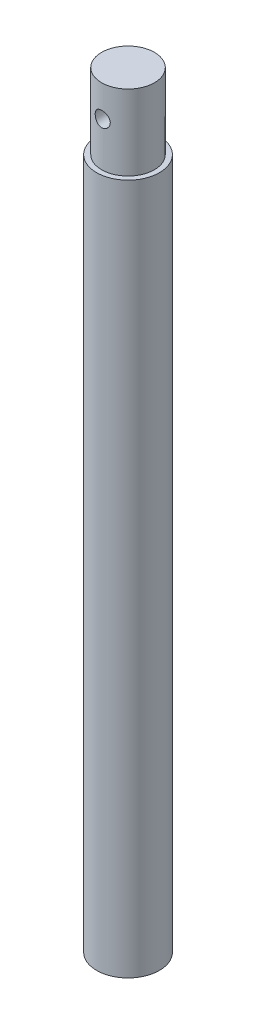
ISO-10303-21;
HEADER;
FILE_DESCRIPTION(('STEP AP214'),'2;1');
FILE_NAME('part.step','',(''),(''),'','','');
FILE_SCHEMA(('AUTOMOTIVE_DESIGN { 1 0 10303 214 1 1 1 1 }'));
ENDSEC;
DATA;
#1=APPLICATION_CONTEXT('core data for automotive mechanical design processes');
#2=APPLICATION_PROTOCOL_DEFINITION('international standard','automotive_design',2000,#1);
#3=PRODUCT_CONTEXT('',#1,'mechanical');
#4=PRODUCT('Part','Part','',(#3));
#5=PRODUCT_RELATED_PRODUCT_CATEGORY('part','',(#4));
#6=PRODUCT_DEFINITION_FORMATION('','',#4);
#7=PRODUCT_DEFINITION_CONTEXT('part definition',#1,'design');
#8=PRODUCT_DEFINITION('design','',#6,#7);
#9=PRODUCT_DEFINITION_SHAPE('','',#8);
#10=(LENGTH_UNIT() NAMED_UNIT(*) SI_UNIT(.MILLI.,.METRE.));
#11=(NAMED_UNIT(*) PLANE_ANGLE_UNIT() SI_UNIT($,.RADIAN.));
#12=(NAMED_UNIT(*) SI_UNIT($,.STERADIAN.) SOLID_ANGLE_UNIT());
#13=UNCERTAINTY_MEASURE_WITH_UNIT(LENGTH_MEASURE(1.E-05),#10,'distance_accuracy_value','');
#14=(GEOMETRIC_REPRESENTATION_CONTEXT(3) GLOBAL_UNCERTAINTY_ASSIGNED_CONTEXT((#13)) GLOBAL_UNIT_ASSIGNED_CONTEXT((#10,
#11,#12)) REPRESENTATION_CONTEXT('',''));
#15=CARTESIAN_POINT('',(0.,0.,0.));
#16=DIRECTION('',(0.,0.,1.));
#17=DIRECTION('',(1.,0.,0.));
#18=AXIS2_PLACEMENT_3D('',#15,#16,#17);
#19=CARTESIAN_POINT('',(0.,0.,0.));
#20=DIRECTION('',(0.,-1.,0.));
#21=DIRECTION('',(0.,0.,-1.));
#22=AXIS2_PLACEMENT_3D('',#19,#20,#21);
#23=PLANE('',#22);
#24=CARTESIAN_POINT('',(0.,0.,0.));
#25=DIRECTION('',(0.,-1.,0.));
#26=DIRECTION('',(0.,0.,-1.));
#27=AXIS2_PLACEMENT_3D('',#24,#25,#26);
#28=CIRCLE('',#27,12.5);
#29=CARTESIAN_POINT('',(0.,0.,-12.5));
#30=VERTEX_POINT('',#29);
#31=EDGE_CURVE('E10',#30,#30,#28,.T.);
#32=ORIENTED_EDGE('',*,*,#31,.T.);
#33=EDGE_LOOP('',(#32));
#34=FACE_BOUND('',#33,.T.);
#35=ADVANCED_FACE('F31',(#34),#23,.T.);
#36=CARTESIAN_POINT('',(0.,0.,0.));
#37=DIRECTION('',(0.,-1.,0.));
#38=DIRECTION('',(0.,0.,-1.));
#39=AXIS2_PLACEMENT_3D('',#36,#37,#38);
#40=CYLINDRICAL_SURFACE('',#39,12.5);
#41=CARTESIAN_POINT('',(0.,275.,0.));
#42=DIRECTION('',(0.,-1.,0.));
#43=DIRECTION('',(0.,0.,-1.));
#44=AXIS2_PLACEMENT_3D('',#41,#42,#43);
#45=CIRCLE('',#44,12.5);
#46=CARTESIAN_POINT('',(0.,275.,-12.5));
#47=VERTEX_POINT('',#46);
#48=EDGE_CURVE('E43',#47,#47,#45,.T.);
#49=ORIENTED_EDGE('',*,*,#48,.T.);
#50=EDGE_LOOP('',(#49));
#51=FACE_BOUND('',#50,.T.);
#52=ORIENTED_EDGE('',*,*,#31,.F.);
#53=EDGE_LOOP('',(#52));
#54=FACE_BOUND('',#53,.T.);
#55=ADVANCED_FACE('F75',(#51,#54),#40,.T.);
#56=CARTESIAN_POINT('',(12.5,275.,0.));
#57=DIRECTION('',(0.,1.,0.));
#58=DIRECTION('',(0.,0.,1.));
#59=AXIS2_PLACEMENT_3D('',#56,#57,#58);
#60=PLANE('',#59);
#61=CARTESIAN_POINT('',(0.,275.,0.));
#62=DIRECTION('',(0.,-1.,0.));
#63=DIRECTION('',(0.,0.,-1.));
#64=AXIS2_PLACEMENT_3D('',#61,#62,#63);
#65=CIRCLE('',#64,10.5);
#66=CARTESIAN_POINT('',(0.,275.,-10.5));
#67=VERTEX_POINT('',#66);
#68=EDGE_CURVE('E48',#67,#67,#65,.T.);
#69=ORIENTED_EDGE('',*,*,#68,.T.);
#70=EDGE_LOOP('',(#69));
#71=FACE_BOUND('',#70,.T.);
#72=ORIENTED_EDGE('',*,*,#48,.F.);
#73=EDGE_LOOP('',(#72));
#74=FACE_BOUND('',#73,.T.);
#75=ADVANCED_FACE('F71',(#71,#74),#60,.T.);
#76=CARTESIAN_POINT('',(0.,0.,0.));
#77=DIRECTION('',(0.,-1.,0.));
#78=DIRECTION('',(0.,0.,-1.));
#79=AXIS2_PLACEMENT_3D('',#76,#77,#78);
#80=CYLINDRICAL_SURFACE('',#79,10.5);
#81=CARTESIAN_POINT('',(0.,295.5,-10.5));
#82=CARTESIAN_POINT('',(0.164932353565877,295.499997090657,-10.4999980394151));
#83=CARTESIAN_POINT('',(0.329894621808872,295.486353316536,-10.4960762610306));
#84=CARTESIAN_POINT('',(0.655037986795479,295.432253594847,-10.4808135891765));
#85=CARTESIAN_POINT('',(0.815217250244417,295.391787500889,-10.4694698881513));
#86=CARTESIAN_POINT('',(1.1260564511068,295.285487942375,-10.4406103702361));
#87=CARTESIAN_POINT('',(1.27672932127233,295.219689845772,-10.4231031615951));
#88=CARTESIAN_POINT('',(1.5649031416939,295.064733012783,-10.3837496747482));
#89=CARTESIAN_POINT('',(1.70240271176725,294.975571832265,-10.3619029426203));
#90=CARTESIAN_POINT('',(1.96394167028842,294.773947483991,-10.3155710193837));
#91=CARTESIAN_POINT('',(2.08758558357141,294.660982869217,-10.2910356291779));
#92=CARTESIAN_POINT('',(2.31445703688652,294.416028385294,-10.2424010237346));
#93=CARTESIAN_POINT('',(2.41768151561674,294.284035668552,-10.2183018743902));
#94=CARTESIAN_POINT('',(2.60279685009645,294.001509625814,-10.1727452231308));
#95=CARTESIAN_POINT('',(2.68421731655021,293.850657022403,-10.1513505375903));
#96=CARTESIAN_POINT('',(2.82037755830969,293.536691982374,-10.11437015761));
#97=CARTESIAN_POINT('',(2.87512307333578,293.373582191894,-10.0987832136731));
#98=CARTESIAN_POINT('',(2.95497649520813,293.044147855252,-10.0757041229402));
#99=CARTESIAN_POINT('',(2.98080829804275,292.878012955848,-10.0680146785502));
#100=CARTESIAN_POINT('',(3.00436001683776,292.543603277331,-10.0610131230299));
#101=CARTESIAN_POINT('',(3.00208604114431,292.375328971125,-10.0616991916142));
#102=CARTESIAN_POINT('',(2.97006202144355,292.047197082816,-10.071195516149));
#103=CARTESIAN_POINT('',(2.94120488592586,291.887243473229,-10.079741740469));
#104=CARTESIAN_POINT('',(2.85827079128683,291.574549170559,-10.1035702257422));
#105=CARTESIAN_POINT('',(2.80419155221875,291.421809130919,-10.1188530956461));
#106=CARTESIAN_POINT('',(2.67166021706719,291.125630633352,-10.1546529527412));
#107=CARTESIAN_POINT('',(2.59290826759323,290.982334391398,-10.1752337460847));
#108=CARTESIAN_POINT('',(2.41347568751828,290.71068515818,-10.2192782532309));
#109=CARTESIAN_POINT('',(2.31279017510018,290.582335503398,-10.2427426083287));
#110=CARTESIAN_POINT('',(2.08785599509534,290.339141436591,-10.2909937598453));
#111=CARTESIAN_POINT('',(1.96286231226802,290.224988286049,-10.3157970685855));
#112=CARTESIAN_POINT('',(1.69519842357936,290.01911099454,-10.3631437082752));
#113=CARTESIAN_POINT('',(1.55252730222285,289.927388015937,-10.3856869220674));
#114=CARTESIAN_POINT('',(1.25238460963716,289.768606897839,-10.4261479209825));
#115=CARTESIAN_POINT('',(1.094834726715,289.701689569794,-10.4440391324584));
#116=CARTESIAN_POINT('',(0.770089844951189,289.595499162875,-10.4729887723138));
#117=CARTESIAN_POINT('',(0.602897288715204,289.556219116132,-10.4840489228438));
#118=CARTESIAN_POINT('',(0.269499582966511,289.507540071436,-10.4978231177201));
#119=CARTESIAN_POINT('',(0.103442020290751,289.497202956941,-10.500799092759));
#120=CARTESIAN_POINT('',(-0.22803979020838,289.504090899452,-10.4988312706064));
#121=CARTESIAN_POINT('',(-0.393464111635665,289.521312649269,-10.4938884237094));
#122=CARTESIAN_POINT('',(-0.715527950145472,289.582065666474,-10.4768089002781));
#123=CARTESIAN_POINT('',(-0.872277317602265,289.625059771985,-10.4648191952651));
#124=CARTESIAN_POINT('',(-1.17631302930846,289.735500752977,-10.4350199811283));
#125=CARTESIAN_POINT('',(-1.32359827687307,289.802950456334,-10.4172097989883));
#126=CARTESIAN_POINT('',(-1.60806252768004,289.962035004968,-10.377149417537));
#127=CARTESIAN_POINT('',(-1.74495372981013,290.054161798238,-10.3548114476745));
#128=CARTESIAN_POINT('',(-2.00165779208922,290.259378758927,-10.3082692064772));
#129=CARTESIAN_POINT('',(-2.12146675626459,290.372473695097,-10.2840645113288));
#130=CARTESIAN_POINT('',(-2.34465964251011,290.620814013074,-10.2355292944394));
#131=CARTESIAN_POINT('',(-2.44737814111066,290.756662913339,-10.211220552866));
#132=CARTESIAN_POINT('',(-2.6285929741014,291.044193882937,-10.1660834210304));
#133=CARTESIAN_POINT('',(-2.70709015123023,291.195875401156,-10.1452549096911));
#134=CARTESIAN_POINT('',(-2.83706181177399,291.510136816463,-10.1096797686107));
#135=CARTESIAN_POINT('',(-2.88867949859412,291.672653645249,-10.094901000323));
#136=CARTESIAN_POINT('',(-2.96369175101872,292.00456490336,-10.0731368501614));
#137=CARTESIAN_POINT('',(-2.98709486852634,292.173957232606,-10.0661491068575));
#138=CARTESIAN_POINT('',(-3.00447036370096,292.507944049425,-10.0609755464887));
#139=CARTESIAN_POINT('',(-2.99952041465636,292.672478256889,-10.0624674105622));
#140=CARTESIAN_POINT('',(-2.96287066435293,292.99826209604,-10.0733189565375));
#141=CARTESIAN_POINT('',(-2.93117175569769,293.159511837145,-10.0826783759017));
#142=CARTESIAN_POINT('',(-2.84258953225373,293.472567556734,-10.1080046578178));
#143=CARTESIAN_POINT('',(-2.78596637679644,293.624453080512,-10.1239031558446));
#144=CARTESIAN_POINT('',(-2.64934423952273,293.916688101743,-10.1605095425217));
#145=CARTESIAN_POINT('',(-2.56934112064701,294.057035551911,-10.181218282206));
#146=CARTESIAN_POINT('',(-2.38509819802268,294.327275282707,-10.2259750342799));
#147=CARTESIAN_POINT('',(-2.28013841584102,294.456662087013,-10.2501114476943));
#148=CARTESIAN_POINT('',(-2.05028976056891,294.696335843715,-10.2985476763752));
#149=CARTESIAN_POINT('',(-1.92539587609278,294.806617978666,-10.3228475312553));
#150=CARTESIAN_POINT('',(-1.6553614812981,295.00775577649,-10.3696193935878));
#151=CARTESIAN_POINT('',(-1.50978375353968,295.098040480905,-10.3920285155618));
#152=CARTESIAN_POINT('',(-1.20487579447001,295.252718677533,-10.4317709366689));
#153=CARTESIAN_POINT('',(-1.04555313617213,295.3171263179,-10.4491070080541));
#154=CARTESIAN_POINT('',(-0.739374473002583,295.411271327093,-10.4749101708797));
#155=CARTESIAN_POINT('',(-0.593644511436613,295.444460305027,-10.4842452654312));
#156=CARTESIAN_POINT('',(-0.298617553179567,295.488824485863,-10.4967906577822));
#157=CARTESIAN_POINT('',(-0.149321036424145,295.500002633965,-10.5000017750099));
#158=CARTESIAN_POINT('',(0.,295.5,-10.5));
#159=B_SPLINE_CURVE_WITH_KNOTS('',3,(#81,#82,#83,#84,#85,#86,#87,#88,#89,#90,#91,#92,#93,#94,
#95,#96,#97,#98,#99,#100,#101,#102,#103,#104,#105,#106,#107,#108,#109,#110,#111,#112,#113,#114,
#115,#116,#117,#118,#119,#120,#121,#122,#123,#124,#125,#126,#127,#128,#129,#130,#131,#132,#133,
#134,#135,#136,#137,#138,#139,#140,#141,#142,#143,#144,#145,#146,#147,#148,#149,#150,#151,#152,
#153,#154,#155,#156,#157,#158),.UNSPECIFIED.,.T.,.F.,(4,2,2,2,2,2,2,2,2,2,2,2,2,2,2,2,2,2,2,2,2,
2,2,2,2,2,2,2,2,2,2,2,2,2,2,2,2,2,4),(0.,0.49424896881351,0.98868500969277,1.48243321934301,
1.97623310315274,2.48171717296173,2.98727696810568,3.50299612950083,4.01860427317211,
4.52099264794132,5.0232718384685,5.50927178744002,5.99531567679191,6.48751204936813,
6.97981808366011,7.49067750903752,8.00156340233173,8.51530651656676,9.02892006021922,
9.52568186547303,10.0223840615197,10.5090771071928,10.9958264486329,11.4931128801668,
11.9905125478168,12.5041815732651,13.0178327244795,13.528718600492,14.0394495868159,
14.5309002242842,15.0223344628624,15.5087564444418,15.9952645500364,16.4980148534283,
17.0008917466999,17.5166696846252,18.032165238584,18.4796920206419,18.9271589164885),.UNSPECIFIED.);
#160=CARTESIAN_POINT('',(0.,295.5,-10.5));
#161=VERTEX_POINT('',#160);
#162=EDGE_CURVE('E34',#161,#161,#159,.T.);
#163=ORIENTED_EDGE('',*,*,#162,.F.);
#164=EDGE_LOOP('',(#163));
#165=FACE_BOUND('',#164,.T.);
#166=CARTESIAN_POINT('',(3.,292.5,10.0623058987491));
#167=CARTESIAN_POINT('',(2.99999703069737,292.664777306818,10.0623082051681));
#168=CARTESIAN_POINT('',(2.98637799899365,292.829584626382,10.0663976951941));
#169=CARTESIAN_POINT('',(2.93238545085253,293.154406858294,10.0822558381005));
#170=CARTESIAN_POINT('',(2.89200105204491,293.314419793651,10.0940276144457));
#171=CARTESIAN_POINT('',(2.78594014939311,293.624905801307,10.1238106428248));
#172=CARTESIAN_POINT('',(2.72030280977814,293.775393227726,10.141812228861));
#173=CARTESIAN_POINT('',(2.56572546094404,294.063251717332,10.1820138164418));
#174=CARTESIAN_POINT('',(2.4767826849952,294.200621220567,10.2042143163778));
#175=CARTESIAN_POINT('',(2.27538720147299,294.462287347972,10.2510267482124));
#176=CARTESIAN_POINT('',(2.16238381669874,294.586151703194,10.2756863394623));
#177=CARTESIAN_POINT('',(1.91725686820389,294.813454174956,10.3242294826802));
#178=CARTESIAN_POINT('',(1.78513106873944,294.916889899684,10.3481129435048));
#179=CARTESIAN_POINT('',(1.50246904823639,295.10224297253,10.3929499800227));
#180=CARTESIAN_POINT('',(1.35163617564281,295.183724429627,10.413840817513));
#181=CARTESIAN_POINT('',(1.03771271285948,295.320002661624,10.449788107283));
#182=CARTESIAN_POINT('',(0.87462451631278,295.37480463186,10.464845695363));
#183=CARTESIAN_POINT('',(0.545337862681792,295.45475169186,10.4870927895035));
#184=CARTESIAN_POINT('',(0.379331697193584,295.480633532557,10.4944774051695));
#185=CARTESIAN_POINT('',(0.0451801536329032,295.504330100825,10.5012314348954));
#186=CARTESIAN_POINT('',(-0.12296480938281,295.502150193506,10.5006023810849));
#187=CARTESIAN_POINT('',(-0.451470293602808,295.470290437623,10.4915401014495));
#188=CARTESIAN_POINT('',(-0.611915319163379,295.441407581043,10.4833330616404));
#189=CARTESIAN_POINT('',(-0.925578333266421,295.358257346303,10.4603082949525));
#190=CARTESIAN_POINT('',(-1.07879588145081,295.303988423607,10.4454901658449));
#191=CARTESIAN_POINT('',(-1.3756107505933,295.171035898782,10.4105854765801));
#192=CARTESIAN_POINT('',(-1.51908456577589,295.092091833288,10.3904430826762));
#193=CARTESIAN_POINT('',(-1.79101086538598,294.912233120403,10.3470415346164));
#194=CARTESIAN_POINT('',(-1.91946004862498,294.811313658498,10.323781697901));
#195=CARTESIAN_POINT('',(-2.16244897282057,294.586191434074,10.2756852452718));
#196=CARTESIAN_POINT('',(-2.27634236637343,294.4612958496,10.2508219404553));
#197=CARTESIAN_POINT('',(-2.48173952362851,294.193927362224,10.2030446068904));
#198=CARTESIAN_POINT('',(-2.57324147068842,294.051453034549,10.1801307363999));
#199=CARTESIAN_POINT('',(-2.73185003977029,293.751403673275,10.1387276218934));
#200=CARTESIAN_POINT('',(-2.79875606678215,293.593717162515,10.1202751628722));
#201=CARTESIAN_POINT('',(-2.90488427239102,293.268670254839,10.0903281646055));
#202=CARTESIAN_POINT('',(-2.94411450602719,293.101312688039,10.0788316009856));
#203=CARTESIAN_POINT('',(-2.99261125801014,292.767779363481,10.0645367282499));
#204=CARTESIAN_POINT('',(-3.00285222236349,292.601757274595,10.0614556698322));
#205=CARTESIAN_POINT('',(-2.99578495079181,292.270367526124,10.0635623938704));
#206=CARTESIAN_POINT('',(-2.9784801513688,292.104999787485,10.0687491448667));
#207=CARTESIAN_POINT('',(-2.91767672138974,291.783538157964,10.0865314508271));
#208=CARTESIAN_POINT('',(-2.87478693276231,291.627318620977,10.0989546444875));
#209=CARTESIAN_POINT('',(-2.76472742799621,291.324297192004,10.1296359589553));
#210=CARTESIAN_POINT('',(-2.69755420840145,291.177496662532,10.1478949216656));
#211=CARTESIAN_POINT('',(-2.53892947682439,290.893466887175,10.1887528201424));
#212=CARTESIAN_POINT('',(-2.44691837593696,290.756564333697,10.2114479607173));
#213=CARTESIAN_POINT('',(-2.24190695527259,290.499785439835,10.258405898247));
#214=CARTESIAN_POINT('',(-2.12890208652206,290.379912799482,10.2826690342141));
#215=CARTESIAN_POINT('',(-1.88056201494838,290.156430872568,10.3310209115414));
#216=CARTESIAN_POINT('',(-1.74460156536085,290.053507542872,10.3550760906922));
#217=CARTESIAN_POINT('',(-1.45677796058633,289.871931477926,10.3994696556899));
#218=CARTESIAN_POINT('',(-1.30491563714729,289.793277474117,10.4198082357812));
#219=CARTESIAN_POINT('',(-0.990649909434259,289.663223569461,10.4543475726961));
#220=CARTESIAN_POINT('',(-0.828337199849463,289.611617415621,10.4685946219087));
#221=CARTESIAN_POINT('',(-0.496868472824892,289.53655979709,10.4895500943583));
#222=CARTESIAN_POINT('',(-0.32771422737816,289.513101089728,10.4962604568454));
#223=CARTESIAN_POINT('',(0.00626735693852194,289.495512849003,10.5012800250491));
#224=CARTESIAN_POINT('',(0.171038446574892,289.500383776376,10.4998755538345));
#225=CARTESIAN_POINT('',(0.497317758633025,289.536957422116,10.4894860368325));
#226=CARTESIAN_POINT('',(0.658826136926399,289.568658855573,10.4805013540605));
#227=CARTESIAN_POINT('',(0.972606199559246,289.657397041468,10.4560320279001));
#228=CARTESIAN_POINT('',(1.12494755015212,289.714204768415,10.4406062107167));
#229=CARTESIAN_POINT('',(1.4180208041426,289.851339237429,10.4048564121577));
#230=CARTESIAN_POINT('',(1.55875090587261,289.931669620641,10.384531672549));
#231=CARTESIAN_POINT('',(1.82915018452918,290.116346006135,10.3403843315799));
#232=CARTESIAN_POINT('',(1.95836599200431,290.221335130174,10.3164756867069));
#233=CARTESIAN_POINT('',(2.19768183348384,290.45116368819,10.2681609748845));
#234=CARTESIAN_POINT('',(2.30777656830815,290.576008606661,10.2437547721302));
#235=CARTESIAN_POINT('',(2.50861269041553,290.845945375463,10.1964605628255));
#236=CARTESIAN_POINT('',(2.59876975076779,290.991482921134,10.1736292752722));
#237=CARTESIAN_POINT('',(2.75321915420787,291.296282797849,10.1329266787307));
#238=CARTESIAN_POINT('',(2.81752597325063,291.455537386599,10.1150525954864));
#239=CARTESIAN_POINT('',(2.91147801020477,291.761480550373,10.0883768936192));
#240=CARTESIAN_POINT('',(2.94458849973062,291.90703552216,10.0786865825825));
#241=CARTESIAN_POINT('',(2.98884910565065,292.201719177521,10.0656505419252));
#242=CARTESIAN_POINT('',(3.00000268774586,292.350847293345,10.0623038110305));
#243=CARTESIAN_POINT('',(3.,292.5,10.0623058987491));
#244=B_SPLINE_CURVE_WITH_KNOTS('',3,(#166,#167,#168,#169,#170,#171,#172,#173,#174,#175,#176,
#177,#178,#179,#180,#181,#182,#183,#184,#185,#186,#187,#188,#189,#190,#191,#192,#193,#194,#195,
#196,#197,#198,#199,#200,#201,#202,#203,#204,#205,#206,#207,#208,#209,#210,#211,#212,#213,#214,
#215,#216,#217,#218,#219,#220,#221,#222,#223,#224,#225,#226,#227,#228,#229,#230,#231,#232,#233,
#234,#235,#236,#237,#238,#239,#240,#241,#242,#243),.UNSPECIFIED.,.T.,.F.,(4,2,2,2,2,2,2,2,2,2,2,
2,2,2,2,2,2,2,2,2,2,2,2,2,2,2,2,2,2,2,2,2,2,2,2,2,2,2,4),(0.,0.493782513545892,
0.987765914428277,1.48098627560463,1.97426521651103,2.48035750809925,2.98650901857726,
3.50207224520768,4.01753503526555,4.5195435154311,5.02145601828625,5.50885556465129,
5.99628476919781,6.48904355067734,6.98191039777249,7.49207419039494,8.00227935944633,
8.51655780947094,9.03068651694039,9.52731545004744,10.023882430522,10.5090793448929,
10.9943462882859,11.491620090681,11.9890017693468,12.5031808256951,13.0173330013149,
13.5275052795166,14.0375462561948,14.5297034653061,15.0218371064038,15.5095711858834,
15.9973808031936,16.4996965312258,17.002151248775,17.5178041863786,18.0331679583122,
18.4801993330748,18.9271601422825),.UNSPECIFIED.);
#245=CARTESIAN_POINT('',(3.,292.5,10.0623058987491));
#246=VERTEX_POINT('',#245);
#247=EDGE_CURVE('E51',#246,#246,#244,.T.);
#248=ORIENTED_EDGE('',*,*,#247,.F.);
#249=EDGE_LOOP('',(#248));
#250=FACE_BOUND('',#249,.T.);
#251=CARTESIAN_POINT('',(0.,305.,0.));
#252=DIRECTION('',(0.,-1.,0.));
#253=DIRECTION('',(0.,0.,-1.));
#254=AXIS2_PLACEMENT_3D('',#251,#252,#253);
#255=CIRCLE('',#254,10.5);
#256=CARTESIAN_POINT('',(0.,305.,-10.5));
#257=VERTEX_POINT('',#256);
#258=EDGE_CURVE('E92',#257,#257,#255,.T.);
#259=ORIENTED_EDGE('',*,*,#258,.T.);
#260=EDGE_LOOP('',(#259));
#261=FACE_BOUND('',#260,.T.);
#262=ORIENTED_EDGE('',*,*,#68,.F.);
#263=EDGE_LOOP('',(#262));
#264=FACE_BOUND('',#263,.T.);
#265=ADVANCED_FACE('F56',(#165,#250,#261,#264),#80,.T.);
#266=CARTESIAN_POINT('',(10.5,305.,0.));
#267=DIRECTION('',(0.,1.,0.));
#268=DIRECTION('',(0.,0.,1.));
#269=AXIS2_PLACEMENT_3D('',#266,#267,#268);
#270=PLANE('',#269);
#271=ORIENTED_EDGE('',*,*,#258,.F.);
#272=EDGE_LOOP('',(#271));
#273=FACE_BOUND('',#272,.T.);
#274=ADVANCED_FACE('F63',(#273),#270,.T.);
#275=CARTESIAN_POINT('',(0.,292.5,-25.));
#276=DIRECTION('',(0.,0.,1.));
#277=DIRECTION('',(1.,0.,0.));
#278=AXIS2_PLACEMENT_3D('',#275,#276,#277);
#279=CYLINDRICAL_SURFACE('',#278,3.);
#280=ORIENTED_EDGE('',*,*,#162,.T.);
#281=EDGE_LOOP('',(#280));
#282=FACE_BOUND('',#281,.T.);
#283=ORIENTED_EDGE('',*,*,#247,.T.);
#284=EDGE_LOOP('',(#283));
#285=FACE_BOUND('',#284,.T.);
#286=ADVANCED_FACE('F60',(#282,#285),#279,.F.);
#287=CLOSED_SHELL('',(#35,#55,#75,#265,#274,#286));
#288=MANIFOLD_SOLID_BREP('B2',#287);
#289=ADVANCED_BREP_SHAPE_REPRESENTATION('',(#18,#288),#14);
#290=SHAPE_DEFINITION_REPRESENTATION(#9,#289);
ENDSEC;
END-ISO-10303-21;
